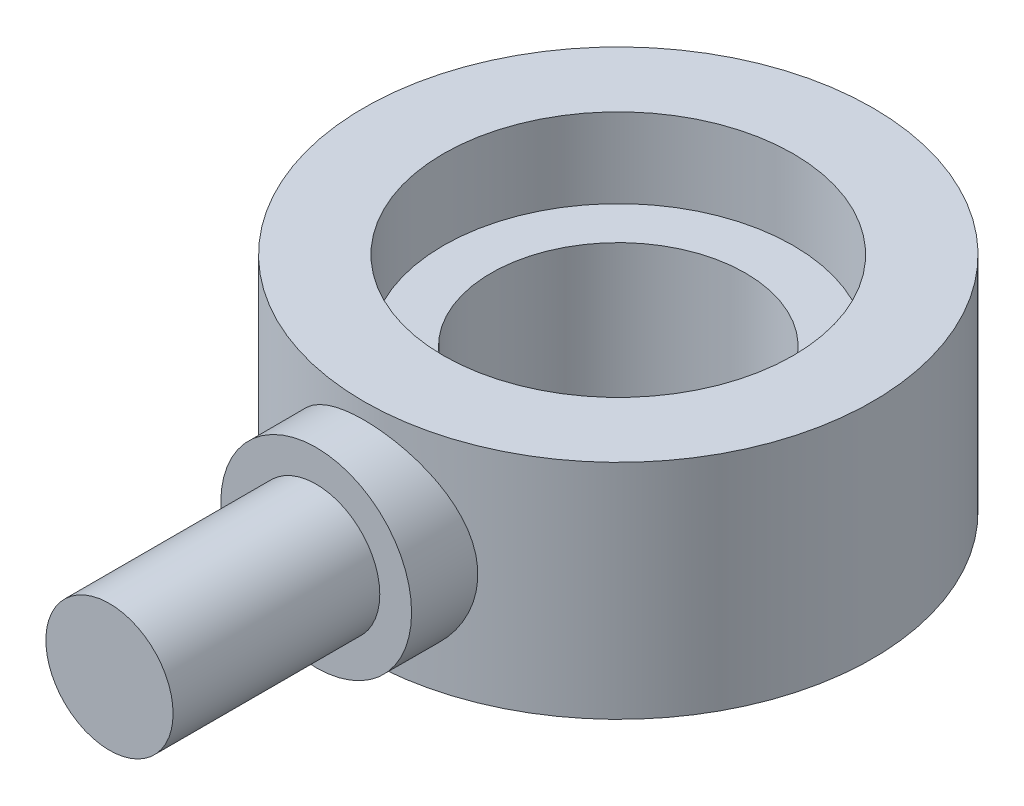
ISO-10303-21;
HEADER;
FILE_DESCRIPTION(('STEP AP214'),'2;1');
FILE_NAME('part.step','',(''),(''),'','','');
FILE_SCHEMA(('AUTOMOTIVE_DESIGN { 1 0 10303 214 1 1 1 1 }'));
ENDSEC;
DATA;
#1=APPLICATION_CONTEXT('core data for automotive mechanical design processes');
#2=APPLICATION_PROTOCOL_DEFINITION('international standard','automotive_design',2000,#1);
#3=PRODUCT_CONTEXT('',#1,'mechanical');
#4=PRODUCT('Part','Part','',(#3));
#5=PRODUCT_RELATED_PRODUCT_CATEGORY('part','',(#4));
#6=PRODUCT_DEFINITION_FORMATION('','',#4);
#7=PRODUCT_DEFINITION_CONTEXT('part definition',#1,'design');
#8=PRODUCT_DEFINITION('design','',#6,#7);
#9=PRODUCT_DEFINITION_SHAPE('','',#8);
#10=(LENGTH_UNIT() NAMED_UNIT(*) SI_UNIT(.MILLI.,.METRE.));
#11=(NAMED_UNIT(*) PLANE_ANGLE_UNIT() SI_UNIT($,.RADIAN.));
#12=(NAMED_UNIT(*) SI_UNIT($,.STERADIAN.) SOLID_ANGLE_UNIT());
#13=UNCERTAINTY_MEASURE_WITH_UNIT(LENGTH_MEASURE(1.E-05),#10,'distance_accuracy_value','');
#14=(GEOMETRIC_REPRESENTATION_CONTEXT(3) GLOBAL_UNCERTAINTY_ASSIGNED_CONTEXT((#13)) GLOBAL_UNIT_ASSIGNED_CONTEXT((#10,
#11,#12)) REPRESENTATION_CONTEXT('',''));
#15=CARTESIAN_POINT('',(0.,0.,0.));
#16=DIRECTION('',(0.,0.,1.));
#17=DIRECTION('',(1.,0.,0.));
#18=AXIS2_PLACEMENT_3D('',#15,#16,#17);
#19=CARTESIAN_POINT('',(0.,7.,0.));
#20=DIRECTION('',(0.,-1.,0.));
#21=DIRECTION('',(0.,0.,-1.));
#22=AXIS2_PLACEMENT_3D('',#19,#20,#21);
#23=CYLINDRICAL_SURFACE('',#22,4.);
#24=CARTESIAN_POINT('',(0.,0.,0.));
#25=DIRECTION('',(0.,1.,0.));
#26=DIRECTION('',(0.,0.,1.));
#27=AXIS2_PLACEMENT_3D('',#24,#25,#26);
#28=CIRCLE('',#27,4.);
#29=CARTESIAN_POINT('',(0.,0.,4.));
#30=VERTEX_POINT('',#29);
#31=EDGE_CURVE('E56',#30,#30,#28,.T.);
#32=ORIENTED_EDGE('',*,*,#31,.F.);
#33=EDGE_LOOP('',(#32));
#34=FACE_BOUND('',#33,.T.);
#35=CARTESIAN_POINT('',(0.,4.5,0.));
#36=DIRECTION('',(0.,1.,0.));
#37=DIRECTION('',(0.,0.,1.));
#38=AXIS2_PLACEMENT_3D('',#35,#36,#37);
#39=CIRCLE('',#38,4.);
#40=CARTESIAN_POINT('',(0.,4.5,4.));
#41=VERTEX_POINT('',#40);
#42=EDGE_CURVE('E39',#41,#41,#39,.T.);
#43=ORIENTED_EDGE('',*,*,#42,.T.);
#44=EDGE_LOOP('',(#43));
#45=FACE_BOUND('',#44,.T.);
#46=ADVANCED_FACE('F34',(#34,#45),#23,.F.);
#47=CARTESIAN_POINT('',(0.,7.,0.));
#48=DIRECTION('',(0.,-1.,0.));
#49=DIRECTION('',(0.,0.,-1.));
#50=AXIS2_PLACEMENT_3D('',#47,#48,#49);
#51=CYLINDRICAL_SURFACE('',#50,8.);
#52=CARTESIAN_POINT('',(0.,7.,0.));
#53=DIRECTION('',(0.,1.,0.));
#54=DIRECTION('',(0.,0.,1.));
#55=AXIS2_PLACEMENT_3D('',#52,#53,#54);
#56=CIRCLE('',#55,8.);
#57=CARTESIAN_POINT('',(0.,7.,8.));
#58=VERTEX_POINT('',#57);
#59=EDGE_CURVE('E48',#58,#58,#56,.T.);
#60=ORIENTED_EDGE('',*,*,#59,.F.);
#61=EDGE_LOOP('',(#60));
#62=FACE_BOUND('',#61,.T.);
#63=CARTESIAN_POINT('',(0.,0.,0.));
#64=DIRECTION('',(0.,1.,0.));
#65=DIRECTION('',(0.,0.,1.));
#66=AXIS2_PLACEMENT_3D('',#63,#64,#65);
#67=CIRCLE('',#66,8.);
#68=CARTESIAN_POINT('',(0.,0.,8.));
#69=VERTEX_POINT('',#68);
#70=EDGE_CURVE('E86',#69,#69,#67,.T.);
#71=ORIENTED_EDGE('',*,*,#70,.T.);
#72=EDGE_LOOP('',(#71));
#73=FACE_BOUND('',#72,.T.);
#74=CARTESIAN_POINT('',(-3.,3.5,7.41619848709566));
#75=CARTESIAN_POINT('',(-3.00000608211288,3.3379850325166,7.41619281215226));
#76=CARTESIAN_POINT('',(-2.98683195095364,3.17601015487381,7.42156520296313));
#77=CARTESIAN_POINT('',(-2.93472375787483,2.85694383406478,7.44232318425766));
#78=CARTESIAN_POINT('',(-2.89579046745932,2.69985224478832,7.45770847484804));
#79=CARTESIAN_POINT('',(-2.79379315222297,2.39524925681117,7.49650960610891));
#80=CARTESIAN_POINT('',(-2.73078694533005,2.24771588670809,7.51990619151695));
#81=CARTESIAN_POINT('',(-2.58263713485087,1.96525620635206,7.57206268400017));
#82=CARTESIAN_POINT('',(-2.49748688189993,1.83033369943215,7.60082420131042));
#83=CARTESIAN_POINT('',(-2.30293322748412,1.5702193767573,7.66207149335192));
#84=CARTESIAN_POINT('',(-2.19260762426636,1.445742940742,7.69466683848217));
#85=CARTESIAN_POINT('',(-1.95279167955762,1.21655437065623,7.75899501256083));
#86=CARTESIAN_POINT('',(-1.82329726051329,1.11184645251608,7.79072765629295));
#87=CARTESIAN_POINT('',(-1.54338931035527,0.921720975408998,7.8510574787339));
#88=CARTESIAN_POINT('',(-1.39241389507607,0.837081050568343,7.87951122447087));
#89=CARTESIAN_POINT('',(-1.07711154393048,0.694697654950117,7.92876015947619));
#90=CARTESIAN_POINT('',(-0.912789261867065,0.636944856016036,7.94955800433994));
#91=CARTESIAN_POINT('',(-0.582978683353668,0.55248420845078,7.98037394206897));
#92=CARTESIAN_POINT('',(-0.417846394563196,0.524544745119085,7.99081830429549));
#93=CARTESIAN_POINT('',(-0.0849287275895665,0.496557598110025,8.0012802821588));
#94=CARTESIAN_POINT('',(0.0828557701256802,0.4965008447626,8.0013012882982));
#95=CARTESIAN_POINT('',(0.40748708612894,0.523563522930328,7.99118531807773));
#96=CARTESIAN_POINT('',(0.564464356533755,0.549338595897557,7.98155083993306));
#97=CARTESIAN_POINT('',(0.871678435968828,0.625071830451177,7.95386549864585));
#98=CARTESIAN_POINT('',(1.02191476686077,0.675031704524346,7.93581403951378));
#99=CARTESIAN_POINT('',(1.31397803460604,0.79834090335142,7.89275538334835));
#100=CARTESIAN_POINT('',(1.45565078457398,0.87202001053579,7.86765078939303));
#101=CARTESIAN_POINT('',(1.72497321591576,1.0403841938598,7.81302620451409));
#102=CARTESIAN_POINT('',(1.85261835386705,1.13507604603903,7.78350479028858));
#103=CARTESIAN_POINT('',(2.09818097359933,1.34925457256232,7.72105059308269));
#104=CARTESIAN_POINT('',(2.21509229051721,1.46986783128531,7.68801927514871));
#105=CARTESIAN_POINT('',(2.42740791139661,1.72918598665867,7.62364921304342));
#106=CARTESIAN_POINT('',(2.52280681389449,1.86789541323143,7.59231089545926));
#107=CARTESIAN_POINT('',(2.69131223613209,2.16343893487736,7.53425406951149));
#108=CARTESIAN_POINT('',(2.76387695690677,2.32060698717146,7.50765354114235));
#109=CARTESIAN_POINT('',(2.88112928869848,2.64619245012777,7.4634487707231));
#110=CARTESIAN_POINT('',(2.925832412077,2.81460354312571,7.44583952363152));
#111=CARTESIAN_POINT('',(2.98380383422379,3.14795192467549,7.42279194491541));
#112=CARTESIAN_POINT('',(2.99867042318746,3.31256821108394,7.41673570495336));
#113=CARTESIAN_POINT('',(3.00115771271731,3.64201871347183,7.41573079037772));
#114=CARTESIAN_POINT('',(2.9887852218731,3.80685286470189,7.42077934004762));
#115=CARTESIAN_POINT('',(2.93859467040517,4.12385984457827,7.44078763262529));
#116=CARTESIAN_POINT('',(2.90201236668503,4.2762622715301,7.45526552433718));
#117=CARTESIAN_POINT('',(2.80599549281221,4.57269588943961,7.49192974091902));
#118=CARTESIAN_POINT('',(2.74655624069231,4.71672535833606,7.51411764500122));
#119=CARTESIAN_POINT('',(2.60400584550571,4.99832887615263,7.56472486232391));
#120=CARTESIAN_POINT('',(2.52009090354098,5.13545858427474,7.59334657784192));
#121=CARTESIAN_POINT('',(2.33182635724954,5.39425796345202,7.6532562858852));
#122=CARTESIAN_POINT('',(2.22746927392868,5.51592194924925,7.68454525188137));
#123=CARTESIAN_POINT('',(1.99345468180189,5.74833674639021,7.74866093106386));
#124=CARTESIAN_POINT('',(1.86261268298213,5.85790681753751,7.7814593871406));
#125=CARTESIAN_POINT('',(1.5835949435063,6.05367673517887,7.84299749926599));
#126=CARTESIAN_POINT('',(1.43541914664534,6.13987650589168,7.87173714215327));
#127=CARTESIAN_POINT('',(1.12603265893695,6.28589211239923,7.92189971409105));
#128=CARTESIAN_POINT('',(0.964868866129253,6.34579824758521,7.9433476267602));
#129=CARTESIAN_POINT('',(0.633763775046509,6.43731282769984,7.97658873425142));
#130=CARTESIAN_POINT('',(0.463826641447185,6.4689345708448,7.98838646598825));
#131=CARTESIAN_POINT('',(0.130671170547631,6.50154880550965,8.00056814634147));
#132=CARTESIAN_POINT('',(-0.032361536121691,6.50421896611798,8.00157721907528));
#133=CARTESIAN_POINT('',(-0.356453572824848,6.48316968110921,7.99369779618447));
#134=CARTESIAN_POINT('',(-0.517513138490515,6.45945341822829,7.98481049426262));
#135=CARTESIAN_POINT('',(-0.829096496754252,6.38748229701276,7.95842179207541));
#136=CARTESIAN_POINT('',(-0.979781462137668,6.33984018824329,7.9411358275603));
#137=CARTESIAN_POINT('',(-1.27103094601278,6.22197997323128,7.89975567241984));
#138=CARTESIAN_POINT('',(-1.41159354255109,6.1517575933905,7.87566019311345));
#139=CARTESIAN_POINT('',(-1.68508035398882,5.98737211299037,7.8218123660013));
#140=CARTESIAN_POINT('',(-1.81743509769369,5.89232671897167,7.79186480217587));
#141=CARTESIAN_POINT('',(-2.06483469504674,5.68238433962482,7.72999015389759));
#142=CARTESIAN_POINT('',(-2.17987334251184,5.56748026838437,7.69806236548317));
#143=CARTESIAN_POINT('',(-2.39562428472386,5.31387173670976,7.63376259478074));
#144=CARTESIAN_POINT('',(-2.49525999632032,5.17423119569092,7.60145610697262));
#145=CARTESIAN_POINT('',(-2.66969419113705,4.87916826085381,7.54196650008334));
#146=CARTESIAN_POINT('',(-2.74449009756384,4.72374423189476,7.51478391266386));
#147=CARTESIAN_POINT('',(-2.86931773948447,4.39408863804739,7.46804539702406));
#148=CARTESIAN_POINT('',(-2.91812005798766,4.21933126696959,7.44887606566003));
#149=CARTESIAN_POINT('',(-2.98344713444437,3.86302945609527,7.42295988688337));
#150=CARTESIAN_POINT('',(-2.99999318680184,3.68148957460557,7.41620484418155));
#151=CARTESIAN_POINT('',(-3.,3.5,7.41619848709566));
#152=B_SPLINE_CURVE_WITH_KNOTS('',3,(#74,#75,#76,#77,#78,#79,#80,#81,#82,#83,#84,#85,#86,#87,
#88,#89,#90,#91,#92,#93,#94,#95,#96,#97,#98,#99,#100,#101,#102,#103,#104,#105,#106,#107,#108,
#109,#110,#111,#112,#113,#114,#115,#116,#117,#118,#119,#120,#121,#122,#123,#124,#125,#126,#127,
#128,#129,#130,#131,#132,#133,#134,#135,#136,#137,#138,#139,#140,#141,#142,#143,#144,#145,#146,
#147,#148,#149,#150,#151),.UNSPECIFIED.,.T.,.F.,(4,2,2,2,2,2,2,2,2,2,2,2,2,2,2,2,2,2,2,2,2,2,2,
2,2,2,2,2,2,2,2,2,2,2,2,2,2,2,4),(0.,0.485369082889299,0.970723629307669,1.45491971362402,
1.93926135947583,2.44549304813252,2.95183257656962,3.47540144283838,3.99878852773656,
4.49960036990354,5.0002493082071,5.47612945617385,5.95204330537667,6.43488262432332,
6.91787787268947,7.42913350142745,7.94051735665666,8.46325184520833,8.98569503290589,
9.47931315500611,9.97280790797409,10.4428769187604,10.9130422687869,11.4008312203128,
11.8887989695235,12.4077003400689,12.9266033932,13.4437101779998,13.9605737113989,
14.4473144111951,14.933996406586,15.4088054802742,15.883704470453,16.3785664737361,
16.8736054180957,17.394771991038,17.9159926110813,18.4600635776149,19.0037752466575),.UNSPECIFIED.);
#153=CARTESIAN_POINT('',(-3.,3.5,7.41619848709566));
#154=VERTEX_POINT('',#153);
#155=EDGE_CURVE('E43',#154,#154,#152,.T.);
#156=ORIENTED_EDGE('',*,*,#155,.F.);
#157=EDGE_LOOP('',(#156));
#158=FACE_BOUND('',#157,.T.);
#159=ADVANCED_FACE('F36',(#62,#73,#158),#51,.T.);
#160=CARTESIAN_POINT('',(0.,7.,0.));
#161=DIRECTION('',(0.,1.,0.));
#162=DIRECTION('',(0.,0.,1.));
#163=AXIS2_PLACEMENT_3D('',#160,#161,#162);
#164=PLANE('',#163);
#165=CARTESIAN_POINT('',(0.,7.,0.));
#166=DIRECTION('',(0.,1.,0.));
#167=DIRECTION('',(0.,0.,1.));
#168=AXIS2_PLACEMENT_3D('',#165,#166,#167);
#169=CIRCLE('',#168,5.5);
#170=CARTESIAN_POINT('',(0.,7.,5.5));
#171=VERTEX_POINT('',#170);
#172=EDGE_CURVE('E152',#171,#171,#169,.T.);
#173=ORIENTED_EDGE('',*,*,#172,.F.);
#174=EDGE_LOOP('',(#173));
#175=FACE_BOUND('',#174,.T.);
#176=ORIENTED_EDGE('',*,*,#59,.T.);
#177=EDGE_LOOP('',(#176));
#178=FACE_BOUND('',#177,.T.);
#179=ADVANCED_FACE('F75',(#175,#178),#164,.T.);
#180=CARTESIAN_POINT('',(0.,0.,0.));
#181=DIRECTION('',(0.,1.,0.));
#182=DIRECTION('',(0.,0.,1.));
#183=AXIS2_PLACEMENT_3D('',#180,#181,#182);
#184=PLANE('',#183);
#185=ORIENTED_EDGE('',*,*,#70,.F.);
#186=EDGE_LOOP('',(#185));
#187=FACE_BOUND('',#186,.T.);
#188=ORIENTED_EDGE('',*,*,#31,.T.);
#189=EDGE_LOOP('',(#188));
#190=FACE_BOUND('',#189,.T.);
#191=ADVANCED_FACE('F69',(#187,#190),#184,.F.);
#192=CARTESIAN_POINT('',(0.,3.5,9.5));
#193=DIRECTION('',(0.,0.,-1.));
#194=DIRECTION('',(-1.,0.,0.));
#195=AXIS2_PLACEMENT_3D('',#192,#193,#194);
#196=CYLINDRICAL_SURFACE('',#195,3.);
#197=CARTESIAN_POINT('',(0.,3.5,9.5));
#198=DIRECTION('',(0.,0.,1.));
#199=DIRECTION('',(1.,0.,0.));
#200=AXIS2_PLACEMENT_3D('',#197,#198,#199);
#201=CIRCLE('',#200,3.);
#202=CARTESIAN_POINT('',(3.,3.5,9.5));
#203=VERTEX_POINT('',#202);
#204=EDGE_CURVE('E54',#203,#203,#201,.T.);
#205=ORIENTED_EDGE('',*,*,#204,.F.);
#206=EDGE_LOOP('',(#205));
#207=FACE_BOUND('',#206,.T.);
#208=ORIENTED_EDGE('',*,*,#155,.T.);
#209=EDGE_LOOP('',(#208));
#210=FACE_BOUND('',#209,.T.);
#211=ADVANCED_FACE('F63',(#207,#210),#196,.T.);
#212=CARTESIAN_POINT('',(0.,3.5,9.5));
#213=DIRECTION('',(0.,0.,1.));
#214=DIRECTION('',(1.,0.,0.));
#215=AXIS2_PLACEMENT_3D('',#212,#213,#214);
#216=PLANE('',#215);
#217=CARTESIAN_POINT('',(0.,3.5,9.5));
#218=DIRECTION('',(0.,0.,1.));
#219=DIRECTION('',(1.,0.,0.));
#220=AXIS2_PLACEMENT_3D('',#217,#218,#219);
#221=CIRCLE('',#220,2.);
#222=CARTESIAN_POINT('',(2.,3.5,9.5));
#223=VERTEX_POINT('',#222);
#224=EDGE_CURVE('E10',#223,#223,#221,.T.);
#225=ORIENTED_EDGE('',*,*,#224,.F.);
#226=EDGE_LOOP('',(#225));
#227=FACE_BOUND('',#226,.T.);
#228=ORIENTED_EDGE('',*,*,#204,.T.);
#229=EDGE_LOOP('',(#228));
#230=FACE_BOUND('',#229,.T.);
#231=ADVANCED_FACE('F68',(#227,#230),#216,.T.);
#232=CARTESIAN_POINT('',(0.,3.5,16.));
#233=DIRECTION('',(0.,0.,-1.));
#234=DIRECTION('',(-1.,0.,0.));
#235=AXIS2_PLACEMENT_3D('',#232,#233,#234);
#236=CYLINDRICAL_SURFACE('',#235,2.);
#237=CARTESIAN_POINT('',(0.,3.5,16.));
#238=DIRECTION('',(0.,0.,1.));
#239=DIRECTION('',(1.,0.,0.));
#240=AXIS2_PLACEMENT_3D('',#237,#238,#239);
#241=CIRCLE('',#240,2.);
#242=CARTESIAN_POINT('',(2.,3.5,16.));
#243=VERTEX_POINT('',#242);
#244=EDGE_CURVE('E52',#243,#243,#241,.T.);
#245=ORIENTED_EDGE('',*,*,#244,.F.);
#246=EDGE_LOOP('',(#245));
#247=FACE_BOUND('',#246,.T.);
#248=ORIENTED_EDGE('',*,*,#224,.T.);
#249=EDGE_LOOP('',(#248));
#250=FACE_BOUND('',#249,.T.);
#251=ADVANCED_FACE('F138',(#247,#250),#236,.T.);
#252=CARTESIAN_POINT('',(0.,3.5,16.));
#253=DIRECTION('',(0.,0.,1.));
#254=DIRECTION('',(1.,0.,0.));
#255=AXIS2_PLACEMENT_3D('',#252,#253,#254);
#256=PLANE('',#255);
#257=ORIENTED_EDGE('',*,*,#244,.T.);
#258=EDGE_LOOP('',(#257));
#259=FACE_BOUND('',#258,.T.);
#260=ADVANCED_FACE('F119',(#259),#256,.T.);
#261=CARTESIAN_POINT('',(0.,4.5,0.));
#262=DIRECTION('',(0.,1.,0.));
#263=DIRECTION('',(0.,0.,1.));
#264=AXIS2_PLACEMENT_3D('',#261,#262,#263);
#265=CYLINDRICAL_SURFACE('',#264,5.5);
#266=CARTESIAN_POINT('',(0.,4.5,0.));
#267=DIRECTION('',(0.,1.,0.));
#268=DIRECTION('',(0.,0.,1.));
#269=AXIS2_PLACEMENT_3D('',#266,#267,#268);
#270=CIRCLE('',#269,5.5);
#271=CARTESIAN_POINT('',(0.,4.5,5.5));
#272=VERTEX_POINT('',#271);
#273=EDGE_CURVE('E149',#272,#272,#270,.T.);
#274=ORIENTED_EDGE('',*,*,#273,.F.);
#275=EDGE_LOOP('',(#274));
#276=FACE_BOUND('',#275,.T.);
#277=ORIENTED_EDGE('',*,*,#172,.T.);
#278=EDGE_LOOP('',(#277));
#279=FACE_BOUND('',#278,.T.);
#280=ADVANCED_FACE('F113',(#276,#279),#265,.F.);
#281=CARTESIAN_POINT('',(0.,4.5,0.));
#282=DIRECTION('',(0.,1.,0.));
#283=DIRECTION('',(0.,0.,1.));
#284=AXIS2_PLACEMENT_3D('',#281,#282,#283);
#285=PLANE('',#284);
#286=ORIENTED_EDGE('',*,*,#42,.F.);
#287=EDGE_LOOP('',(#286));
#288=FACE_BOUND('',#287,.T.);
#289=ORIENTED_EDGE('',*,*,#273,.T.);
#290=EDGE_LOOP('',(#289));
#291=FACE_BOUND('',#290,.T.);
#292=ADVANCED_FACE('F118',(#288,#291),#285,.T.);
#293=CLOSED_SHELL('',(#46,#159,#179,#191,#211,#231,#251,#260,#280,#292));
#294=MANIFOLD_SOLID_BREP('B2',#293);
#295=ADVANCED_BREP_SHAPE_REPRESENTATION('',(#18,#294),#14);
#296=SHAPE_DEFINITION_REPRESENTATION(#9,#295);
ENDSEC;
END-ISO-10303-21;
